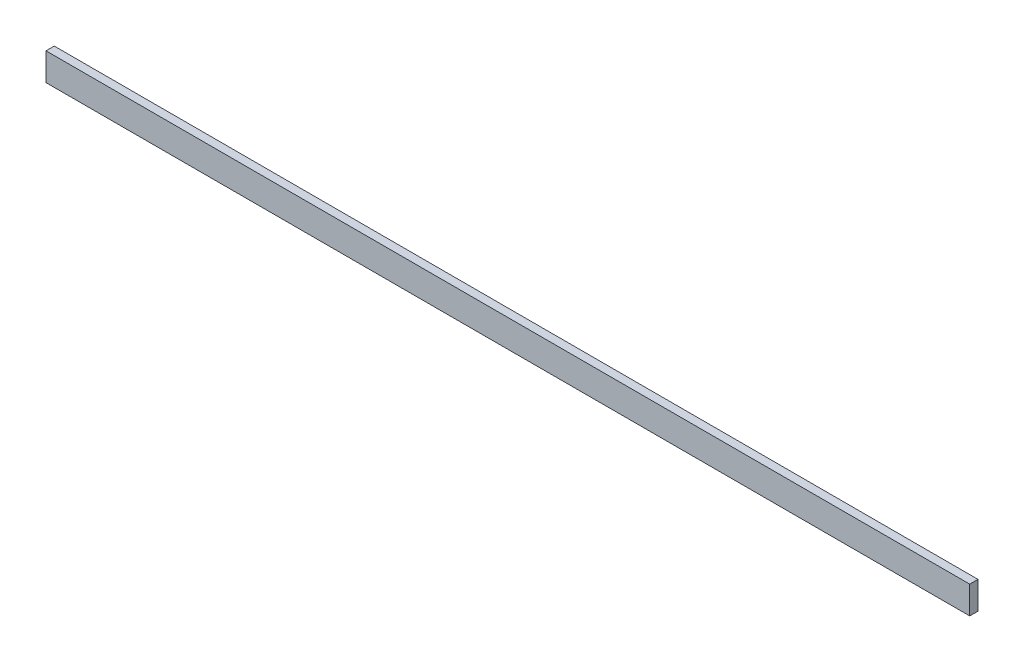
ISO-10303-21;
HEADER;
FILE_DESCRIPTION(('STEP AP214'),'2;1');
FILE_NAME('part.step','',(''),(''),'','','');
FILE_SCHEMA(('AUTOMOTIVE_DESIGN { 1 0 10303 214 1 1 1 1 }'));
ENDSEC;
DATA;
#1=APPLICATION_CONTEXT('core data for automotive mechanical design processes');
#2=APPLICATION_PROTOCOL_DEFINITION('international standard','automotive_design',2000,#1);
#3=PRODUCT_CONTEXT('',#1,'mechanical');
#4=PRODUCT('Part','Part','',(#3));
#5=PRODUCT_RELATED_PRODUCT_CATEGORY('part','',(#4));
#6=PRODUCT_DEFINITION_FORMATION('','',#4);
#7=PRODUCT_DEFINITION_CONTEXT('part definition',#1,'design');
#8=PRODUCT_DEFINITION('design','',#6,#7);
#9=PRODUCT_DEFINITION_SHAPE('','',#8);
#10=(LENGTH_UNIT() NAMED_UNIT(*) SI_UNIT(.MILLI.,.METRE.));
#11=(NAMED_UNIT(*) PLANE_ANGLE_UNIT() SI_UNIT($,.RADIAN.));
#12=(NAMED_UNIT(*) SI_UNIT($,.STERADIAN.) SOLID_ANGLE_UNIT());
#13=UNCERTAINTY_MEASURE_WITH_UNIT(LENGTH_MEASURE(1.E-05),#10,'distance_accuracy_value','');
#14=(GEOMETRIC_REPRESENTATION_CONTEXT(3) GLOBAL_UNCERTAINTY_ASSIGNED_CONTEXT((#13)) GLOBAL_UNIT_ASSIGNED_CONTEXT((#10,
#11,#12)) REPRESENTATION_CONTEXT('',''));
#15=CARTESIAN_POINT('',(0.,0.,0.));
#16=DIRECTION('',(0.,0.,1.));
#17=DIRECTION('',(1.,0.,0.));
#18=AXIS2_PLACEMENT_3D('',#15,#16,#17);
#19=CARTESIAN_POINT('',(0.,0.,3.));
#20=DIRECTION('',(1.,0.,0.));
#21=DIRECTION('',(0.,1.,0.));
#22=AXIS2_PLACEMENT_3D('',#19,#20,#21);
#23=PLANE('',#22);
#24=DIRECTION('',(0.,-1.,0.));
#25=VECTOR('',#24,1.);
#26=CARTESIAN_POINT('',(0.,0.,0.));
#27=LINE('',#26,#25);
#28=CARTESIAN_POINT('',(0.,0.,0.));
#29=VERTEX_POINT('',#28);
#30=CARTESIAN_POINT('',(0.,-10.,0.));
#31=VERTEX_POINT('',#30);
#32=EDGE_CURVE('E100',#29,#31,#27,.T.);
#33=ORIENTED_EDGE('',*,*,#32,.T.);
#34=DIRECTION('',(0.,0.,-1.));
#35=VECTOR('',#34,1.);
#36=CARTESIAN_POINT('',(0.,-10.,3.));
#37=LINE('',#36,#35);
#38=CARTESIAN_POINT('',(0.,-10.,3.));
#39=VERTEX_POINT('',#38);
#40=EDGE_CURVE('E11',#39,#31,#37,.T.);
#41=ORIENTED_EDGE('',*,*,#40,.F.);
#42=DIRECTION('',(0.,-1.,0.));
#43=VECTOR('',#42,1.);
#44=CARTESIAN_POINT('',(0.,0.,3.));
#45=LINE('',#44,#43);
#46=CARTESIAN_POINT('',(0.,0.,3.));
#47=VERTEX_POINT('',#46);
#48=EDGE_CURVE('E88',#47,#39,#45,.T.);
#49=ORIENTED_EDGE('',*,*,#48,.F.);
#50=DIRECTION('',(0.,0.,-1.));
#51=VECTOR('',#50,1.);
#52=CARTESIAN_POINT('',(0.,0.,3.));
#53=LINE('',#52,#51);
#54=EDGE_CURVE('E96',#47,#29,#53,.T.);
#55=ORIENTED_EDGE('',*,*,#54,.T.);
#56=EDGE_LOOP('',(#33,#41,#49,#55));
#57=FACE_BOUND('',#56,.T.);
#58=ADVANCED_FACE('F37',(#57),#23,.F.);
#59=CARTESIAN_POINT('',(0.,-10.,3.));
#60=DIRECTION('',(0.,1.,0.));
#61=DIRECTION('',(0.,0.,1.));
#62=AXIS2_PLACEMENT_3D('',#59,#60,#61);
#63=PLANE('',#62);
#64=DIRECTION('',(1.,0.,0.));
#65=VECTOR('',#64,1.);
#66=CARTESIAN_POINT('',(0.,-10.,0.));
#67=LINE('',#66,#65);
#68=CARTESIAN_POINT('',(335.,-10.,0.));
#69=VERTEX_POINT('',#68);
#70=EDGE_CURVE('E92',#31,#69,#67,.T.);
#71=ORIENTED_EDGE('',*,*,#70,.T.);
#72=DIRECTION('',(0.,0.,-1.));
#73=VECTOR('',#72,1.);
#74=CARTESIAN_POINT('',(335.,-10.,3.));
#75=LINE('',#74,#73);
#76=CARTESIAN_POINT('',(335.,-10.,3.));
#77=VERTEX_POINT('',#76);
#78=EDGE_CURVE('E45',#77,#69,#75,.T.);
#79=ORIENTED_EDGE('',*,*,#78,.F.);
#80=DIRECTION('',(1.,0.,0.));
#81=VECTOR('',#80,1.);
#82=CARTESIAN_POINT('',(0.,-10.,3.));
#83=LINE('',#82,#81);
#84=EDGE_CURVE('E83',#39,#77,#83,.T.);
#85=ORIENTED_EDGE('',*,*,#84,.F.);
#86=ORIENTED_EDGE('',*,*,#40,.T.);
#87=EDGE_LOOP('',(#71,#79,#85,#86));
#88=FACE_BOUND('',#87,.T.);
#89=ADVANCED_FACE('F91',(#88),#63,.F.);
#90=CARTESIAN_POINT('',(335.,0.,3.));
#91=DIRECTION('',(-1.,0.,0.));
#92=DIRECTION('',(0.,0.,1.));
#93=AXIS2_PLACEMENT_3D('',#90,#91,#92);
#94=PLANE('',#93);
#95=DIRECTION('',(0.,1.,0.));
#96=VECTOR('',#95,1.);
#97=CARTESIAN_POINT('',(335.,0.,0.));
#98=LINE('',#97,#96);
#99=CARTESIAN_POINT('',(335.,0.,0.));
#100=VERTEX_POINT('',#99);
#101=EDGE_CURVE('E70',#69,#100,#98,.T.);
#102=ORIENTED_EDGE('',*,*,#101,.T.);
#103=DIRECTION('',(0.,0.,-1.));
#104=VECTOR('',#103,1.);
#105=CARTESIAN_POINT('',(335.,0.,3.));
#106=LINE('',#105,#104);
#107=CARTESIAN_POINT('',(335.,0.,3.));
#108=VERTEX_POINT('',#107);
#109=EDGE_CURVE('E93',#108,#100,#106,.T.);
#110=ORIENTED_EDGE('',*,*,#109,.F.);
#111=DIRECTION('',(0.,1.,0.));
#112=VECTOR('',#111,1.);
#113=CARTESIAN_POINT('',(335.,0.,3.));
#114=LINE('',#113,#112);
#115=EDGE_CURVE('E86',#77,#108,#114,.T.);
#116=ORIENTED_EDGE('',*,*,#115,.F.);
#117=ORIENTED_EDGE('',*,*,#78,.T.);
#118=EDGE_LOOP('',(#102,#110,#116,#117));
#119=FACE_BOUND('',#118,.T.);
#120=ADVANCED_FACE('F94',(#119),#94,.F.);
#121=CARTESIAN_POINT('',(0.,0.,3.));
#122=DIRECTION('',(0.,-1.,0.));
#123=DIRECTION('',(0.,0.,-1.));
#124=AXIS2_PLACEMENT_3D('',#121,#122,#123);
#125=PLANE('',#124);
#126=DIRECTION('',(-1.,0.,0.));
#127=VECTOR('',#126,1.);
#128=CARTESIAN_POINT('',(0.,0.,0.));
#129=LINE('',#128,#127);
#130=EDGE_CURVE('E76',#100,#29,#129,.T.);
#131=ORIENTED_EDGE('',*,*,#130,.T.);
#132=ORIENTED_EDGE('',*,*,#54,.F.);
#133=DIRECTION('',(-1.,0.,0.));
#134=VECTOR('',#133,1.);
#135=CARTESIAN_POINT('',(0.,0.,3.));
#136=LINE('',#135,#134);
#137=EDGE_CURVE('E53',#108,#47,#136,.T.);
#138=ORIENTED_EDGE('',*,*,#137,.F.);
#139=ORIENTED_EDGE('',*,*,#109,.T.);
#140=EDGE_LOOP('',(#131,#132,#138,#139));
#141=FACE_BOUND('',#140,.T.);
#142=ADVANCED_FACE('F107',(#141),#125,.F.);
#143=CARTESIAN_POINT('',(0.,0.,3.));
#144=DIRECTION('',(0.,0.,1.));
#145=DIRECTION('',(1.,0.,0.));
#146=AXIS2_PLACEMENT_3D('',#143,#144,#145);
#147=PLANE('',#146);
#148=ORIENTED_EDGE('',*,*,#48,.T.);
#149=ORIENTED_EDGE('',*,*,#84,.T.);
#150=ORIENTED_EDGE('',*,*,#115,.T.);
#151=ORIENTED_EDGE('',*,*,#137,.T.);
#152=EDGE_LOOP('',(#148,#149,#150,#151));
#153=FACE_BOUND('',#152,.T.);
#154=ADVANCED_FACE('F84',(#153),#147,.T.);
#155=CARTESIAN_POINT('',(0.,0.,0.));
#156=DIRECTION('',(0.,0.,1.));
#157=DIRECTION('',(1.,0.,0.));
#158=AXIS2_PLACEMENT_3D('',#155,#156,#157);
#159=PLANE('',#158);
#160=ORIENTED_EDGE('',*,*,#32,.F.);
#161=ORIENTED_EDGE('',*,*,#130,.F.);
#162=ORIENTED_EDGE('',*,*,#101,.F.);
#163=ORIENTED_EDGE('',*,*,#70,.F.);
#164=EDGE_LOOP('',(#160,#161,#162,#163));
#165=FACE_BOUND('',#164,.T.);
#166=ADVANCED_FACE('F110',(#165),#159,.F.);
#167=CLOSED_SHELL('',(#58,#89,#120,#142,#154,#166));
#168=MANIFOLD_SOLID_BREP('B2',#167);
#169=ADVANCED_BREP_SHAPE_REPRESENTATION('',(#18,#168),#14);
#170=SHAPE_DEFINITION_REPRESENTATION(#9,#169);
ENDSEC;
END-ISO-10303-21;
